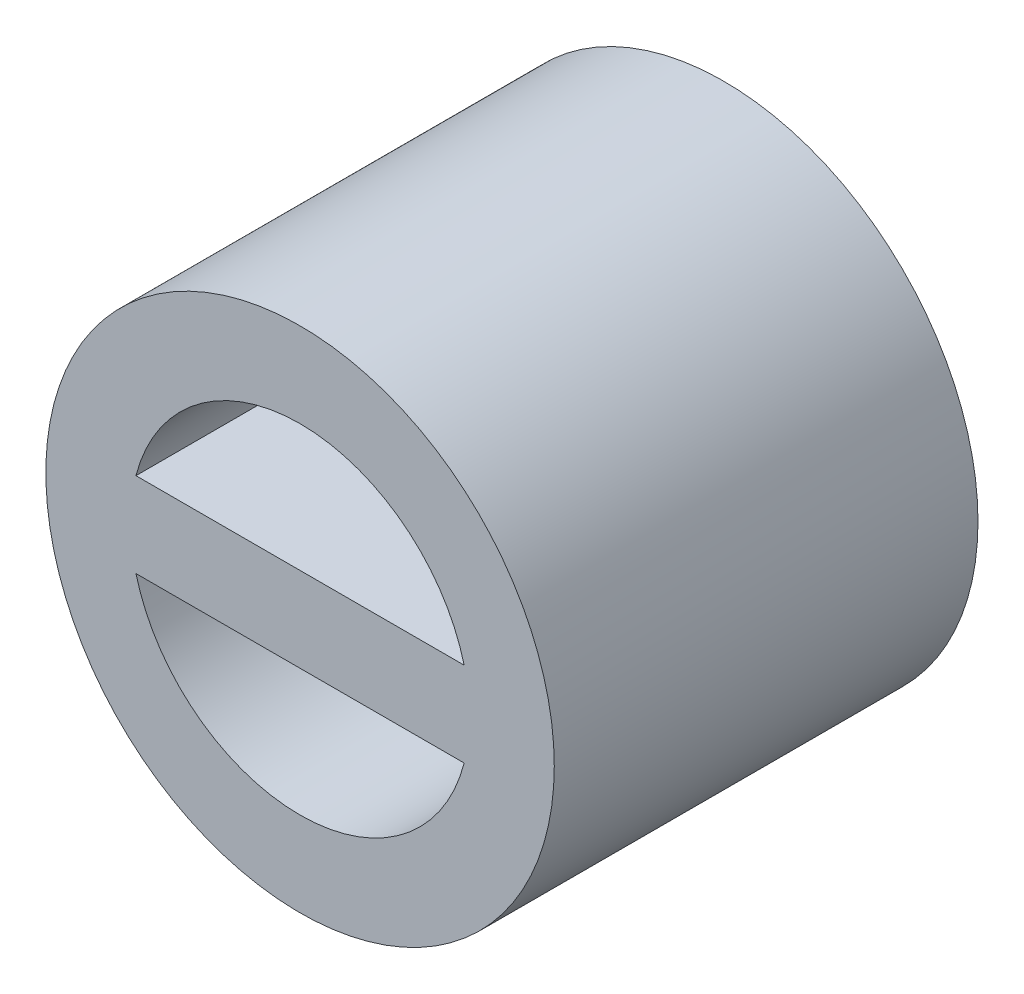
ISO-10303-21;
HEADER;
FILE_DESCRIPTION(('STEP AP214'),'2;1');
FILE_NAME('part.step','',(''),(''),'','','');
FILE_SCHEMA(('AUTOMOTIVE_DESIGN { 1 0 10303 214 1 1 1 1 }'));
ENDSEC;
DATA;
#1=APPLICATION_CONTEXT('core data for automotive mechanical design processes');
#2=APPLICATION_PROTOCOL_DEFINITION('international standard','automotive_design',2000,#1);
#3=PRODUCT_CONTEXT('',#1,'mechanical');
#4=PRODUCT('Part','Part','',(#3));
#5=PRODUCT_RELATED_PRODUCT_CATEGORY('part','',(#4));
#6=PRODUCT_DEFINITION_FORMATION('','',#4);
#7=PRODUCT_DEFINITION_CONTEXT('part definition',#1,'design');
#8=PRODUCT_DEFINITION('design','',#6,#7);
#9=PRODUCT_DEFINITION_SHAPE('','',#8);
#10=(LENGTH_UNIT() NAMED_UNIT(*) SI_UNIT(.MILLI.,.METRE.));
#11=(NAMED_UNIT(*) PLANE_ANGLE_UNIT() SI_UNIT($,.RADIAN.));
#12=(NAMED_UNIT(*) SI_UNIT($,.STERADIAN.) SOLID_ANGLE_UNIT());
#13=UNCERTAINTY_MEASURE_WITH_UNIT(LENGTH_MEASURE(1.E-05),#10,'distance_accuracy_value','');
#14=(GEOMETRIC_REPRESENTATION_CONTEXT(3) GLOBAL_UNCERTAINTY_ASSIGNED_CONTEXT((#13)) GLOBAL_UNIT_ASSIGNED_CONTEXT((#10,
#11,#12)) REPRESENTATION_CONTEXT('',''));
#15=CARTESIAN_POINT('',(0.,0.,0.));
#16=DIRECTION('',(0.,0.,1.));
#17=DIRECTION('',(1.,0.,0.));
#18=AXIS2_PLACEMENT_3D('',#15,#16,#17);
#19=CARTESIAN_POINT('',(0.,23.0322572976377,-98.999691437051));
#20=DIRECTION('',(0.,0.,1.));
#21=DIRECTION('',(1.,0.,0.));
#22=AXIS2_PLACEMENT_3D('',#19,#20,#21);
#23=PLANE('',#22);
#24=CARTESIAN_POINT('',(7.5,15.,-98.999691437051));
#25=DIRECTION('',(0.,0.,1.));
#26=DIRECTION('',(1.,0.,0.));
#27=AXIS2_PLACEMENT_3D('',#24,#25,#26);
#28=CIRCLE('',#27,2.);
#29=CARTESIAN_POINT('',(9.5,15.,-98.999691437051));
#30=VERTEX_POINT('',#29);
#31=EDGE_CURVE('E100',#30,#30,#28,.F.);
#32=ORIENTED_EDGE('',*,*,#31,.F.);
#33=EDGE_LOOP('',(#32));
#34=FACE_BOUND('',#33,.T.);
#35=CARTESIAN_POINT('',(7.5,15.,-98.999691437051));
#36=DIRECTION('',(0.,0.,1.));
#37=DIRECTION('',(1.,0.,0.));
#38=AXIS2_PLACEMENT_3D('',#35,#36,#37);
#39=CIRCLE('',#38,3.);
#40=CARTESIAN_POINT('',(10.5,15.,-98.999691437051));
#41=VERTEX_POINT('',#40);
#42=EDGE_CURVE('E39',#41,#41,#39,.T.);
#43=ORIENTED_EDGE('',*,*,#42,.F.);
#44=EDGE_LOOP('',(#43));
#45=FACE_BOUND('',#44,.T.);
#46=ADVANCED_FACE('F36',(#34,#45),#23,.F.);
#47=CARTESIAN_POINT('',(7.5,15.,-93.999691437051));
#48=DIRECTION('',(0.,0.,1.));
#49=DIRECTION('',(1.,0.,0.));
#50=AXIS2_PLACEMENT_3D('',#47,#48,#49);
#51=PLANE('',#50);
#52=CARTESIAN_POINT('',(7.5,15.,-93.999691437051));
#53=DIRECTION('',(0.,0.,1.));
#54=DIRECTION('',(1.,0.,0.));
#55=AXIS2_PLACEMENT_3D('',#52,#53,#54);
#56=CIRCLE('',#55,2.);
#57=CARTESIAN_POINT('',(5.56350832689629,14.5,-93.999691437051));
#58=VERTEX_POINT('',#57);
#59=CARTESIAN_POINT('',(9.43649167310371,14.5,-93.999691437051));
#60=VERTEX_POINT('',#59);
#61=EDGE_CURVE('E88',#58,#60,#56,.T.);
#62=ORIENTED_EDGE('',*,*,#61,.F.);
#63=DIRECTION('',(1.,0.,0.));
#64=VECTOR('',#63,1.);
#65=CARTESIAN_POINT('',(9.43649167310371,14.5,-93.999691437051));
#66=LINE('',#65,#64);
#67=EDGE_CURVE('E11',#58,#60,#66,.T.);
#68=ORIENTED_EDGE('',*,*,#67,.T.);
#69=EDGE_LOOP('',(#62,#68));
#70=FACE_BOUND('',#69,.T.);
#71=CARTESIAN_POINT('',(7.5,15.,-93.999691437051));
#72=DIRECTION('',(0.,0.,1.));
#73=DIRECTION('',(1.,0.,0.));
#74=AXIS2_PLACEMENT_3D('',#71,#72,#73);
#75=CIRCLE('',#74,3.);
#76=CARTESIAN_POINT('',(10.5,15.,-93.999691437051));
#77=VERTEX_POINT('',#76);
#78=EDGE_CURVE('E102',#77,#77,#75,.T.);
#79=ORIENTED_EDGE('',*,*,#78,.T.);
#80=EDGE_LOOP('',(#79));
#81=FACE_BOUND('',#80,.T.);
#82=CARTESIAN_POINT('',(9.43649167310371,15.5,-93.999691437051));
#83=VERTEX_POINT('',#82);
#84=CARTESIAN_POINT('',(5.56350832689629,15.5,-93.999691437051));
#85=VERTEX_POINT('',#84);
#86=EDGE_CURVE('E109',#83,#85,#56,.T.);
#87=ORIENTED_EDGE('',*,*,#86,.F.);
#88=DIRECTION('',(-1.,0.,0.));
#89=VECTOR('',#88,1.);
#90=CARTESIAN_POINT('',(5.56350832689629,15.5,-93.999691437051));
#91=LINE('',#90,#89);
#92=EDGE_CURVE('E44',#83,#85,#91,.T.);
#93=ORIENTED_EDGE('',*,*,#92,.T.);
#94=EDGE_LOOP('',(#87,#93));
#95=FACE_BOUND('',#94,.T.);
#96=ADVANCED_FACE('F119',(#70,#81,#95),#51,.T.);
#97=CARTESIAN_POINT('',(9.43649167310371,14.5,-103.122797062669));
#98=DIRECTION('',(0.,-1.,0.));
#99=DIRECTION('',(0.,0.,-1.));
#100=AXIS2_PLACEMENT_3D('',#97,#98,#99);
#101=PLANE('',#100);
#102=DIRECTION('',(-1.,0.,0.));
#103=VECTOR('',#102,1.);
#104=CARTESIAN_POINT('',(9.43649167310371,14.5,-96.499691437051));
#105=LINE('',#104,#103);
#106=CARTESIAN_POINT('',(9.43649167310371,14.5,-96.499691437051));
#107=VERTEX_POINT('',#106);
#108=CARTESIAN_POINT('',(5.56350832689629,14.5,-96.499691437051));
#109=VERTEX_POINT('',#108);
#110=EDGE_CURVE('E75',#107,#109,#105,.T.);
#111=ORIENTED_EDGE('',*,*,#110,.F.);
#112=DIRECTION('',(0.,0.,1.));
#113=VECTOR('',#112,1.);
#114=CARTESIAN_POINT('',(9.43649167310371,14.5,-103.122797062669));
#115=LINE('',#114,#113);
#116=EDGE_CURVE('E55',#107,#60,#115,.T.);
#117=ORIENTED_EDGE('',*,*,#116,.T.);
#118=ORIENTED_EDGE('',*,*,#67,.F.);
#119=DIRECTION('',(0.,0.,1.));
#120=VECTOR('',#119,1.);
#121=CARTESIAN_POINT('',(5.56350832689629,14.5,-103.122797062669));
#122=LINE('',#121,#120);
#123=EDGE_CURVE('E72',#109,#58,#122,.T.);
#124=ORIENTED_EDGE('',*,*,#123,.F.);
#125=EDGE_LOOP('',(#111,#117,#118,#124));
#126=FACE_BOUND('',#125,.T.);
#127=ADVANCED_FACE('F74',(#126),#101,.T.);
#128=CARTESIAN_POINT('',(-19.3090792980731,-59.1911110560317,-96.499691437051));
#129=DIRECTION('',(0.,0.,1.));
#130=DIRECTION('',(1.,0.,0.));
#131=AXIS2_PLACEMENT_3D('',#128,#129,#130);
#132=PLANE('',#131);
#133=CARTESIAN_POINT('',(7.5,15.,-96.499691437051));
#134=DIRECTION('',(0.,0.,1.));
#135=DIRECTION('',(1.,0.,0.));
#136=AXIS2_PLACEMENT_3D('',#133,#134,#135);
#137=CIRCLE('',#136,2.);
#138=CARTESIAN_POINT('',(5.56350832689629,15.5,-96.499691437051));
#139=VERTEX_POINT('',#138);
#140=EDGE_CURVE('E84',#109,#139,#137,.F.);
#141=ORIENTED_EDGE('',*,*,#140,.T.);
#142=DIRECTION('',(1.,0.,0.));
#143=VECTOR('',#142,1.);
#144=CARTESIAN_POINT('',(5.56350832689629,15.5,-96.499691437051));
#145=LINE('',#144,#143);
#146=CARTESIAN_POINT('',(9.43649167310371,15.5,-96.499691437051));
#147=VERTEX_POINT('',#146);
#148=EDGE_CURVE('E95',#139,#147,#145,.T.);
#149=ORIENTED_EDGE('',*,*,#148,.T.);
#150=CARTESIAN_POINT('',(7.5,15.,-96.499691437051));
#151=DIRECTION('',(0.,0.,1.));
#152=DIRECTION('',(1.,0.,0.));
#153=AXIS2_PLACEMENT_3D('',#150,#151,#152);
#154=CIRCLE('',#153,2.);
#155=EDGE_CURVE('E87',#147,#107,#154,.F.);
#156=ORIENTED_EDGE('',*,*,#155,.T.);
#157=ORIENTED_EDGE('',*,*,#110,.T.);
#158=EDGE_LOOP('',(#141,#149,#156,#157));
#159=FACE_BOUND('',#158,.T.);
#160=ADVANCED_FACE('F82',(#159),#132,.F.);
#161=CARTESIAN_POINT('',(5.56350832689629,15.5,-103.122797062669));
#162=DIRECTION('',(0.,1.,0.));
#163=DIRECTION('',(0.,0.,1.));
#164=AXIS2_PLACEMENT_3D('',#161,#162,#163);
#165=PLANE('',#164);
#166=ORIENTED_EDGE('',*,*,#148,.F.);
#167=DIRECTION('',(0.,0.,1.));
#168=VECTOR('',#167,1.);
#169=CARTESIAN_POINT('',(5.56350832689629,15.5,-103.122797062669));
#170=LINE('',#169,#168);
#171=EDGE_CURVE('E94',#139,#85,#170,.T.);
#172=ORIENTED_EDGE('',*,*,#171,.T.);
#173=ORIENTED_EDGE('',*,*,#92,.F.);
#174=DIRECTION('',(0.,0.,1.));
#175=VECTOR('',#174,1.);
#176=CARTESIAN_POINT('',(9.43649167310371,15.5,-103.122797062669));
#177=LINE('',#176,#175);
#178=EDGE_CURVE('E113',#147,#83,#177,.T.);
#179=ORIENTED_EDGE('',*,*,#178,.F.);
#180=EDGE_LOOP('',(#166,#172,#173,#179));
#181=FACE_BOUND('',#180,.T.);
#182=ADVANCED_FACE('F121',(#181),#165,.T.);
#183=CARTESIAN_POINT('',(7.5,15.,-93.999691437051));
#184=DIRECTION('',(0.,0.,-1.));
#185=DIRECTION('',(-1.,0.,0.));
#186=AXIS2_PLACEMENT_3D('',#183,#184,#185);
#187=CYLINDRICAL_SURFACE('',#186,2.);
#188=ORIENTED_EDGE('',*,*,#171,.F.);
#189=ORIENTED_EDGE('',*,*,#140,.F.);
#190=ORIENTED_EDGE('',*,*,#123,.T.);
#191=ORIENTED_EDGE('',*,*,#61,.T.);
#192=ORIENTED_EDGE('',*,*,#116,.F.);
#193=ORIENTED_EDGE('',*,*,#155,.F.);
#194=ORIENTED_EDGE('',*,*,#178,.T.);
#195=ORIENTED_EDGE('',*,*,#86,.T.);
#196=EDGE_LOOP('',(#188,#189,#190,#191,#192,#193,#194,#195));
#197=FACE_BOUND('',#196,.T.);
#198=ORIENTED_EDGE('',*,*,#31,.T.);
#199=EDGE_LOOP('',(#198));
#200=FACE_BOUND('',#199,.T.);
#201=ADVANCED_FACE('F91',(#197,#200),#187,.F.);
#202=CARTESIAN_POINT('',(7.5,15.,-93.999691437051));
#203=DIRECTION('',(0.,0.,-1.));
#204=DIRECTION('',(-1.,0.,0.));
#205=AXIS2_PLACEMENT_3D('',#202,#203,#204);
#206=CYLINDRICAL_SURFACE('',#205,3.);
#207=ORIENTED_EDGE('',*,*,#78,.F.);
#208=EDGE_LOOP('',(#207));
#209=FACE_BOUND('',#208,.T.);
#210=ORIENTED_EDGE('',*,*,#42,.T.);
#211=EDGE_LOOP('',(#210));
#212=FACE_BOUND('',#211,.T.);
#213=ADVANCED_FACE('F128',(#209,#212),#206,.T.);
#214=CLOSED_SHELL('',(#46,#96,#127,#160,#182,#201,#213));
#215=MANIFOLD_SOLID_BREP('B2',#214);
#216=ADVANCED_BREP_SHAPE_REPRESENTATION('',(#18,#215),#14);
#217=SHAPE_DEFINITION_REPRESENTATION(#9,#216);
ENDSEC;
END-ISO-10303-21;
